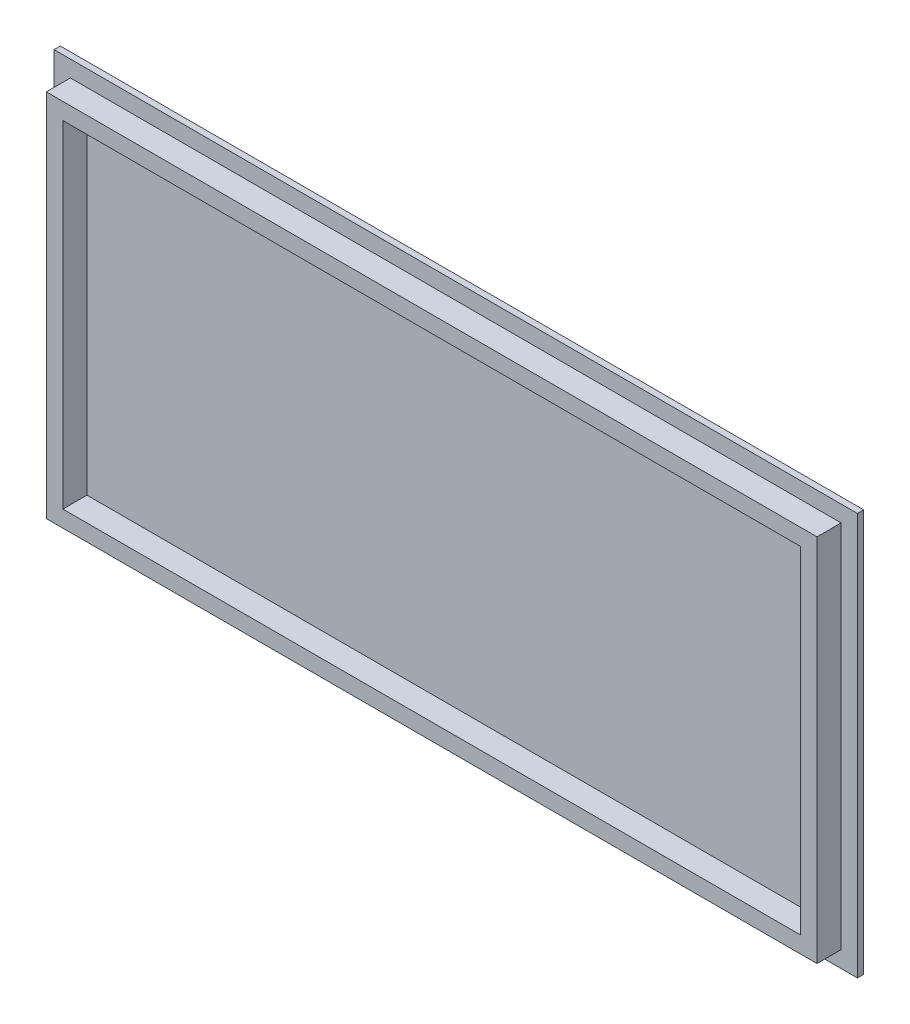
ISO-10303-21;
HEADER;
FILE_DESCRIPTION(('STEP AP214'),'2;1');
FILE_NAME('part.step','',(''),(''),'','','');
FILE_SCHEMA(('AUTOMOTIVE_DESIGN { 1 0 10303 214 1 1 1 1 }'));
ENDSEC;
DATA;
#1=APPLICATION_CONTEXT('core data for automotive mechanical design processes');
#2=APPLICATION_PROTOCOL_DEFINITION('international standard','automotive_design',2000,#1);
#3=PRODUCT_CONTEXT('',#1,'mechanical');
#4=PRODUCT('Part','Part','',(#3));
#5=PRODUCT_RELATED_PRODUCT_CATEGORY('part','',(#4));
#6=PRODUCT_DEFINITION_FORMATION('','',#4);
#7=PRODUCT_DEFINITION_CONTEXT('part definition',#1,'design');
#8=PRODUCT_DEFINITION('design','',#6,#7);
#9=PRODUCT_DEFINITION_SHAPE('','',#8);
#10=(LENGTH_UNIT() NAMED_UNIT(*) SI_UNIT(.MILLI.,.METRE.));
#11=(NAMED_UNIT(*) PLANE_ANGLE_UNIT() SI_UNIT($,.RADIAN.));
#12=(NAMED_UNIT(*) SI_UNIT($,.STERADIAN.) SOLID_ANGLE_UNIT());
#13=UNCERTAINTY_MEASURE_WITH_UNIT(LENGTH_MEASURE(1.E-05),#10,'distance_accuracy_value','');
#14=(GEOMETRIC_REPRESENTATION_CONTEXT(3) GLOBAL_UNCERTAINTY_ASSIGNED_CONTEXT((#13)) GLOBAL_UNIT_ASSIGNED_CONTEXT((#10,
#11,#12)) REPRESENTATION_CONTEXT('',''));
#15=CARTESIAN_POINT('',(0.,0.,0.));
#16=DIRECTION('',(0.,0.,1.));
#17=DIRECTION('',(1.,0.,0.));
#18=AXIS2_PLACEMENT_3D('',#15,#16,#17);
#19=CARTESIAN_POINT('',(0.,0.,3.));
#20=DIRECTION('',(0.,0.,1.));
#21=DIRECTION('',(1.,0.,0.));
#22=AXIS2_PLACEMENT_3D('',#19,#20,#21);
#23=PLANE('',#22);
#24=DIRECTION('',(0.,-1.,0.));
#25=VECTOR('',#24,1.);
#26=CARTESIAN_POINT('',(-7.91969303707388,-7.74484427014725,3.));
#27=LINE('',#26,#25);
#28=CARTESIAN_POINT('',(-7.91969303707386,184.295155729853,3.));
#29=VERTEX_POINT('',#28);
#30=CARTESIAN_POINT('',(-7.91969303707388,-7.74484427014725,3.));
#31=VERTEX_POINT('',#30);
#32=EDGE_CURVE('E194',#29,#31,#27,.T.);
#33=ORIENTED_EDGE('',*,*,#32,.T.);
#34=DIRECTION('',(1.,0.,0.));
#35=VECTOR('',#34,1.);
#36=CARTESIAN_POINT('',(375.550306962926,-7.74484427014723,3.));
#37=LINE('',#36,#35);
#38=CARTESIAN_POINT('',(375.550306962926,-7.74484427014723,3.));
#39=VERTEX_POINT('',#38);
#40=EDGE_CURVE('E197',#31,#39,#37,.T.);
#41=ORIENTED_EDGE('',*,*,#40,.T.);
#42=DIRECTION('',(0.,1.,0.));
#43=VECTOR('',#42,1.);
#44=CARTESIAN_POINT('',(375.550306962926,-7.74484427014723,3.));
#45=LINE('',#44,#43);
#46=CARTESIAN_POINT('',(375.550306962926,184.295155729853,3.));
#47=VERTEX_POINT('',#46);
#48=EDGE_CURVE('E200',#39,#47,#45,.T.);
#49=ORIENTED_EDGE('',*,*,#48,.T.);
#50=DIRECTION('',(-1.,0.,0.));
#51=VECTOR('',#50,1.);
#52=CARTESIAN_POINT('',(375.550306962926,184.295155729853,3.));
#53=LINE('',#52,#51);
#54=EDGE_CURVE('E202',#47,#29,#53,.T.);
#55=ORIENTED_EDGE('',*,*,#54,.T.);
#56=EDGE_LOOP('',(#33,#41,#49,#55));
#57=FACE_BOUND('',#56,.T.);
#58=DIRECTION('',(0.,-1.,0.));
#59=VECTOR('',#58,1.);
#60=CARTESIAN_POINT('',(367.772314810922,0.,3.));
#61=LINE('',#60,#59);
#62=CARTESIAN_POINT('',(367.772314810922,176.491576554324,3.));
#63=VERTEX_POINT('',#62);
#64=CARTESIAN_POINT('',(367.772314810922,0.0815765543243918,3.));
#65=VERTEX_POINT('',#64);
#66=EDGE_CURVE('E167',#63,#65,#61,.T.);
#67=ORIENTED_EDGE('',*,*,#66,.T.);
#68=DIRECTION('',(-1.,0.,0.));
#69=VECTOR('',#68,1.);
#70=CARTESIAN_POINT('',(0.,0.081576554324378,3.));
#71=LINE('',#70,#69);
#72=CARTESIAN_POINT('',(-0.107685189077916,0.0815765543243779,3.));
#73=VERTEX_POINT('',#72);
#74=EDGE_CURVE('E59',#65,#73,#71,.T.);
#75=ORIENTED_EDGE('',*,*,#74,.T.);
#76=DIRECTION('',(0.,1.,0.));
#77=VECTOR('',#76,1.);
#78=CARTESIAN_POINT('',(-0.107685189077916,0.,3.));
#79=LINE('',#78,#77);
#80=CARTESIAN_POINT('',(-0.107685189077901,176.491576554324,3.));
#81=VERTEX_POINT('',#80);
#82=EDGE_CURVE('E178',#73,#81,#79,.T.);
#83=ORIENTED_EDGE('',*,*,#82,.T.);
#84=DIRECTION('',(1.,0.,0.));
#85=VECTOR('',#84,1.);
#86=CARTESIAN_POINT('',(0.,176.491576554324,3.));
#87=LINE('',#86,#85);
#88=EDGE_CURVE('E181',#81,#63,#87,.T.);
#89=ORIENTED_EDGE('',*,*,#88,.T.);
#90=EDGE_LOOP('',(#67,#75,#83,#89));
#91=FACE_BOUND('',#90,.T.);
#92=ADVANCED_FACE('F36',(#57,#91),#23,.T.);
#93=CARTESIAN_POINT('',(-7.91969303707388,-7.74484427014725,3.));
#94=DIRECTION('',(1.,0.,0.));
#95=DIRECTION('',(0.,1.,0.));
#96=AXIS2_PLACEMENT_3D('',#93,#94,#95);
#97=PLANE('',#96);
#98=DIRECTION('',(0.,-1.,0.));
#99=VECTOR('',#98,1.);
#100=CARTESIAN_POINT('',(-7.91969303707388,-7.74484427014725,0.));
#101=LINE('',#100,#99);
#102=CARTESIAN_POINT('',(-7.91969303707386,184.295155729853,0.));
#103=VERTEX_POINT('',#102);
#104=CARTESIAN_POINT('',(-7.91969303707388,-7.74484427014725,0.));
#105=VERTEX_POINT('',#104);
#106=EDGE_CURVE('E188',#103,#105,#101,.T.);
#107=ORIENTED_EDGE('',*,*,#106,.T.);
#108=DIRECTION('',(0.,0.,-1.));
#109=VECTOR('',#108,1.);
#110=CARTESIAN_POINT('',(-7.91969303707388,-7.74484427014725,3.));
#111=LINE('',#110,#109);
#112=EDGE_CURVE('E11',#31,#105,#111,.T.);
#113=ORIENTED_EDGE('',*,*,#112,.F.);
#114=ORIENTED_EDGE('',*,*,#32,.F.);
#115=DIRECTION('',(0.,0.,-1.));
#116=VECTOR('',#115,1.);
#117=CARTESIAN_POINT('',(-7.91969303707386,184.295155729853,3.));
#118=LINE('',#117,#116);
#119=EDGE_CURVE('E204',#29,#103,#118,.T.);
#120=ORIENTED_EDGE('',*,*,#119,.T.);
#121=EDGE_LOOP('',(#107,#113,#114,#120));
#122=FACE_BOUND('',#121,.T.);
#123=ADVANCED_FACE('F38',(#122),#97,.F.);
#124=CARTESIAN_POINT('',(375.550306962926,-7.74484427014723,3.));
#125=DIRECTION('',(0.,1.,0.));
#126=DIRECTION('',(-1.,0.,0.));
#127=AXIS2_PLACEMENT_3D('',#124,#125,#126);
#128=PLANE('',#127);
#129=DIRECTION('',(1.,0.,0.));
#130=VECTOR('',#129,1.);
#131=CARTESIAN_POINT('',(375.550306962926,-7.74484427014723,0.));
#132=LINE('',#131,#130);
#133=CARTESIAN_POINT('',(375.550306962926,-7.74484427014723,0.));
#134=VERTEX_POINT('',#133);
#135=EDGE_CURVE('E207',#105,#134,#132,.T.);
#136=ORIENTED_EDGE('',*,*,#135,.T.);
#137=DIRECTION('',(0.,0.,-1.));
#138=VECTOR('',#137,1.);
#139=CARTESIAN_POINT('',(375.550306962926,-7.74484427014723,3.));
#140=LINE('',#139,#138);
#141=EDGE_CURVE('E44',#39,#134,#140,.T.);
#142=ORIENTED_EDGE('',*,*,#141,.F.);
#143=ORIENTED_EDGE('',*,*,#40,.F.);
#144=ORIENTED_EDGE('',*,*,#112,.T.);
#145=EDGE_LOOP('',(#136,#142,#143,#144));
#146=FACE_BOUND('',#145,.T.);
#147=ADVANCED_FACE('F237',(#146),#128,.F.);
#148=CARTESIAN_POINT('',(375.550306962926,-7.74484427014723,3.));
#149=DIRECTION('',(-1.,0.,0.));
#150=DIRECTION('',(0.,0.,1.));
#151=AXIS2_PLACEMENT_3D('',#148,#149,#150);
#152=PLANE('',#151);
#153=DIRECTION('',(0.,1.,0.));
#154=VECTOR('',#153,1.);
#155=CARTESIAN_POINT('',(375.550306962926,-7.74484427014723,0.));
#156=LINE('',#155,#154);
#157=CARTESIAN_POINT('',(375.550306962926,184.295155729853,0.));
#158=VERTEX_POINT('',#157);
#159=EDGE_CURVE('E209',#134,#158,#156,.T.);
#160=ORIENTED_EDGE('',*,*,#159,.T.);
#161=DIRECTION('',(0.,0.,-1.));
#162=VECTOR('',#161,1.);
#163=CARTESIAN_POINT('',(375.550306962926,184.295155729853,3.));
#164=LINE('',#163,#162);
#165=EDGE_CURVE('E214',#47,#158,#164,.T.);
#166=ORIENTED_EDGE('',*,*,#165,.F.);
#167=ORIENTED_EDGE('',*,*,#48,.F.);
#168=ORIENTED_EDGE('',*,*,#141,.T.);
#169=EDGE_LOOP('',(#160,#166,#167,#168));
#170=FACE_BOUND('',#169,.T.);
#171=ADVANCED_FACE('F221',(#170),#152,.F.);
#172=CARTESIAN_POINT('',(375.550306962926,184.295155729853,3.));
#173=DIRECTION('',(0.,-1.,0.));
#174=DIRECTION('',(1.,0.,0.));
#175=AXIS2_PLACEMENT_3D('',#172,#173,#174);
#176=PLANE('',#175);
#177=DIRECTION('',(-1.,0.,0.));
#178=VECTOR('',#177,1.);
#179=CARTESIAN_POINT('',(375.550306962926,184.295155729853,0.));
#180=LINE('',#179,#178);
#181=EDGE_CURVE('E198',#158,#103,#180,.T.);
#182=ORIENTED_EDGE('',*,*,#181,.T.);
#183=ORIENTED_EDGE('',*,*,#119,.F.);
#184=ORIENTED_EDGE('',*,*,#54,.F.);
#185=ORIENTED_EDGE('',*,*,#165,.T.);
#186=EDGE_LOOP('',(#182,#183,#184,#185));
#187=FACE_BOUND('',#186,.T.);
#188=ADVANCED_FACE('F230',(#187),#176,.F.);
#189=CARTESIAN_POINT('',(0.,0.,0.));
#190=DIRECTION('',(0.,0.,1.));
#191=DIRECTION('',(1.,0.,0.));
#192=AXIS2_PLACEMENT_3D('',#189,#190,#191);
#193=PLANE('',#192);
#194=ORIENTED_EDGE('',*,*,#106,.F.);
#195=ORIENTED_EDGE('',*,*,#181,.F.);
#196=ORIENTED_EDGE('',*,*,#159,.F.);
#197=ORIENTED_EDGE('',*,*,#135,.F.);
#198=EDGE_LOOP('',(#194,#195,#196,#197));
#199=FACE_BOUND('',#198,.T.);
#200=ADVANCED_FACE('F227',(#199),#193,.F.);
#201=CARTESIAN_POINT('',(0.,0.081576554324378,14.5));
#202=DIRECTION('',(0.,-1.,0.));
#203=DIRECTION('',(1.,0.,0.));
#204=AXIS2_PLACEMENT_3D('',#201,#202,#203);
#205=PLANE('',#204);
#206=ORIENTED_EDGE('',*,*,#74,.F.);
#207=DIRECTION('',(0.,0.,-1.));
#208=VECTOR('',#207,1.);
#209=CARTESIAN_POINT('',(367.772314810922,0.0815765543243918,14.5));
#210=LINE('',#209,#208);
#211=CARTESIAN_POINT('',(367.772314810922,0.0815765543243918,14.5));
#212=VERTEX_POINT('',#211);
#213=EDGE_CURVE('E186',#212,#65,#210,.T.);
#214=ORIENTED_EDGE('',*,*,#213,.F.);
#215=DIRECTION('',(-1.,0.,0.));
#216=VECTOR('',#215,1.);
#217=CARTESIAN_POINT('',(0.,0.081576554324378,14.5));
#218=LINE('',#217,#216);
#219=CARTESIAN_POINT('',(-0.107685189077916,0.0815765543243779,14.5));
#220=VERTEX_POINT('',#219);
#221=EDGE_CURVE('E163',#212,#220,#218,.T.);
#222=ORIENTED_EDGE('',*,*,#221,.T.);
#223=DIRECTION('',(0.,0.,-1.));
#224=VECTOR('',#223,1.);
#225=CARTESIAN_POINT('',(-0.107685189077916,0.0815765543243779,14.5));
#226=LINE('',#225,#224);
#227=EDGE_CURVE('E176',#220,#73,#226,.T.);
#228=ORIENTED_EDGE('',*,*,#227,.T.);
#229=EDGE_LOOP('',(#206,#214,#222,#228));
#230=FACE_BOUND('',#229,.T.);
#231=ADVANCED_FACE('F250',(#230),#205,.T.);
#232=CARTESIAN_POINT('',(367.772314810922,0.,14.5));
#233=DIRECTION('',(1.,0.,0.));
#234=DIRECTION('',(0.,0.,-1.));
#235=AXIS2_PLACEMENT_3D('',#232,#233,#234);
#236=PLANE('',#235);
#237=ORIENTED_EDGE('',*,*,#66,.F.);
#238=DIRECTION('',(0.,0.,-1.));
#239=VECTOR('',#238,1.);
#240=CARTESIAN_POINT('',(367.772314810922,176.491576554324,14.5));
#241=LINE('',#240,#239);
#242=CARTESIAN_POINT('',(367.772314810922,176.491576554324,14.5));
#243=VERTEX_POINT('',#242);
#244=EDGE_CURVE('E189',#243,#63,#241,.T.);
#245=ORIENTED_EDGE('',*,*,#244,.F.);
#246=DIRECTION('',(0.,-1.,0.));
#247=VECTOR('',#246,1.);
#248=CARTESIAN_POINT('',(367.772314810922,0.,14.5));
#249=LINE('',#248,#247);
#250=EDGE_CURVE('E173',#243,#212,#249,.T.);
#251=ORIENTED_EDGE('',*,*,#250,.T.);
#252=ORIENTED_EDGE('',*,*,#213,.T.);
#253=EDGE_LOOP('',(#237,#245,#251,#252));
#254=FACE_BOUND('',#253,.T.);
#255=ADVANCED_FACE('F269',(#254),#236,.T.);
#256=CARTESIAN_POINT('',(0.,176.491576554324,14.5));
#257=DIRECTION('',(0.,1.,0.));
#258=DIRECTION('',(-1.,0.,0.));
#259=AXIS2_PLACEMENT_3D('',#256,#257,#258);
#260=PLANE('',#259);
#261=ORIENTED_EDGE('',*,*,#88,.F.);
#262=DIRECTION('',(0.,0.,-1.));
#263=VECTOR('',#262,1.);
#264=CARTESIAN_POINT('',(-0.107685189077901,176.491576554324,14.5));
#265=LINE('',#264,#263);
#266=CARTESIAN_POINT('',(-0.107685189077901,176.491576554324,14.5));
#267=VERTEX_POINT('',#266);
#268=EDGE_CURVE('E191',#267,#81,#265,.T.);
#269=ORIENTED_EDGE('',*,*,#268,.F.);
#270=DIRECTION('',(1.,0.,0.));
#271=VECTOR('',#270,1.);
#272=CARTESIAN_POINT('',(0.,176.491576554324,14.5));
#273=LINE('',#272,#271);
#274=EDGE_CURVE('E170',#267,#243,#273,.T.);
#275=ORIENTED_EDGE('',*,*,#274,.T.);
#276=ORIENTED_EDGE('',*,*,#244,.T.);
#277=EDGE_LOOP('',(#261,#269,#275,#276));
#278=FACE_BOUND('',#277,.T.);
#279=ADVANCED_FACE('F275',(#278),#260,.T.);
#280=CARTESIAN_POINT('',(-0.107685189077916,0.,14.5));
#281=DIRECTION('',(-1.,0.,0.));
#282=DIRECTION('',(0.,-1.,0.));
#283=AXIS2_PLACEMENT_3D('',#280,#281,#282);
#284=PLANE('',#283);
#285=ORIENTED_EDGE('',*,*,#82,.F.);
#286=ORIENTED_EDGE('',*,*,#227,.F.);
#287=DIRECTION('',(0.,1.,0.));
#288=VECTOR('',#287,1.);
#289=CARTESIAN_POINT('',(-0.107685189077916,0.,14.5));
#290=LINE('',#289,#288);
#291=EDGE_CURVE('E166',#220,#267,#290,.T.);
#292=ORIENTED_EDGE('',*,*,#291,.T.);
#293=ORIENTED_EDGE('',*,*,#268,.T.);
#294=EDGE_LOOP('',(#285,#286,#292,#293));
#295=FACE_BOUND('',#294,.T.);
#296=ADVANCED_FACE('F283',(#295),#284,.T.);
#297=CARTESIAN_POINT('',(0.,0.,14.5));
#298=DIRECTION('',(0.,0.,-1.));
#299=DIRECTION('',(-1.,0.,0.));
#300=AXIS2_PLACEMENT_3D('',#297,#298,#299);
#301=PLANE('',#300);
#302=DIRECTION('',(0.,1.,0.));
#303=VECTOR('',#302,1.);
#304=CARTESIAN_POINT('',(359.862427543318,0.,14.5));
#305=LINE('',#304,#303);
#306=CARTESIAN_POINT('',(359.862427543318,7.97262699999995,14.5));
#307=VERTEX_POINT('',#306);
#308=CARTESIAN_POINT('',(359.862427543318,168.592627,14.5));
#309=VERTEX_POINT('',#308);
#310=EDGE_CURVE('E154',#307,#309,#305,.T.);
#311=ORIENTED_EDGE('',*,*,#310,.F.);
#312=DIRECTION('',(1.,0.,0.));
#313=VECTOR('',#312,1.);
#314=CARTESIAN_POINT('',(0.,7.97262699999995,14.5));
#315=LINE('',#314,#313);
#316=CARTESIAN_POINT('',(7.79242754331808,7.97262699999995,14.5));
#317=VERTEX_POINT('',#316);
#318=EDGE_CURVE('E51',#317,#307,#315,.T.);
#319=ORIENTED_EDGE('',*,*,#318,.F.);
#320=DIRECTION('',(0.,-1.,0.));
#321=VECTOR('',#320,1.);
#322=CARTESIAN_POINT('',(7.79242754331808,0.,14.5));
#323=LINE('',#322,#321);
#324=CARTESIAN_POINT('',(7.79242754331808,168.592627,14.5));
#325=VERTEX_POINT('',#324);
#326=EDGE_CURVE('E145',#325,#317,#323,.T.);
#327=ORIENTED_EDGE('',*,*,#326,.F.);
#328=DIRECTION('',(-1.,0.,0.));
#329=VECTOR('',#328,1.);
#330=CARTESIAN_POINT('',(0.,168.592627,14.5));
#331=LINE('',#330,#329);
#332=EDGE_CURVE('E148',#309,#325,#331,.T.);
#333=ORIENTED_EDGE('',*,*,#332,.F.);
#334=EDGE_LOOP('',(#311,#319,#327,#333));
#335=FACE_BOUND('',#334,.T.);
#336=ORIENTED_EDGE('',*,*,#221,.F.);
#337=ORIENTED_EDGE('',*,*,#250,.F.);
#338=ORIENTED_EDGE('',*,*,#274,.F.);
#339=ORIENTED_EDGE('',*,*,#291,.F.);
#340=EDGE_LOOP('',(#336,#337,#338,#339));
#341=FACE_BOUND('',#340,.T.);
#342=ADVANCED_FACE('F291',(#335,#341),#301,.F.);
#343=CARTESIAN_POINT('',(0.,7.97262699999995,3.));
#344=DIRECTION('',(0.,-1.,0.));
#345=DIRECTION('',(0.,0.,-1.));
#346=AXIS2_PLACEMENT_3D('',#343,#344,#345);
#347=PLANE('',#346);
#348=ORIENTED_EDGE('',*,*,#318,.T.);
#349=DIRECTION('',(0.,0.,1.));
#350=VECTOR('',#349,1.);
#351=CARTESIAN_POINT('',(359.862427543318,7.97262699999995,3.));
#352=LINE('',#351,#350);
#353=CARTESIAN_POINT('',(359.862427543318,7.97262699999995,3.));
#354=VERTEX_POINT('',#353);
#355=EDGE_CURVE('E123',#354,#307,#352,.T.);
#356=ORIENTED_EDGE('',*,*,#355,.F.);
#357=DIRECTION('',(1.,0.,0.));
#358=VECTOR('',#357,1.);
#359=CARTESIAN_POINT('',(0.,7.97262699999995,3.));
#360=LINE('',#359,#358);
#361=CARTESIAN_POINT('',(7.79242754331808,7.97262699999995,3.));
#362=VERTEX_POINT('',#361);
#363=EDGE_CURVE('E127',#362,#354,#360,.T.);
#364=ORIENTED_EDGE('',*,*,#363,.F.);
#365=DIRECTION('',(0.,0.,1.));
#366=VECTOR('',#365,1.);
#367=CARTESIAN_POINT('',(7.79242754331808,7.97262699999995,3.));
#368=LINE('',#367,#366);
#369=EDGE_CURVE('E158',#362,#317,#368,.T.);
#370=ORIENTED_EDGE('',*,*,#369,.T.);
#371=EDGE_LOOP('',(#348,#356,#364,#370));
#372=FACE_BOUND('',#371,.T.);
#373=ADVANCED_FACE('F125',(#372),#347,.F.);
#374=CARTESIAN_POINT('',(7.79242754331808,0.,3.));
#375=DIRECTION('',(-1.,0.,0.));
#376=DIRECTION('',(0.,0.,1.));
#377=AXIS2_PLACEMENT_3D('',#374,#375,#376);
#378=PLANE('',#377);
#379=ORIENTED_EDGE('',*,*,#326,.T.);
#380=ORIENTED_EDGE('',*,*,#369,.F.);
#381=DIRECTION('',(0.,-1.,0.));
#382=VECTOR('',#381,1.);
#383=CARTESIAN_POINT('',(7.79242754331808,0.,3.));
#384=LINE('',#383,#382);
#385=CARTESIAN_POINT('',(7.79242754331808,168.592627,3.));
#386=VERTEX_POINT('',#385);
#387=EDGE_CURVE('E133',#386,#362,#384,.T.);
#388=ORIENTED_EDGE('',*,*,#387,.F.);
#389=DIRECTION('',(0.,0.,1.));
#390=VECTOR('',#389,1.);
#391=CARTESIAN_POINT('',(7.79242754331808,168.592627,3.));
#392=LINE('',#391,#390);
#393=EDGE_CURVE('E160',#386,#325,#392,.T.);
#394=ORIENTED_EDGE('',*,*,#393,.T.);
#395=EDGE_LOOP('',(#379,#380,#388,#394));
#396=FACE_BOUND('',#395,.T.);
#397=ADVANCED_FACE('F305',(#396),#378,.F.);
#398=CARTESIAN_POINT('',(0.,168.592627,3.));
#399=DIRECTION('',(0.,1.,0.));
#400=DIRECTION('',(0.,0.,1.));
#401=AXIS2_PLACEMENT_3D('',#398,#399,#400);
#402=PLANE('',#401);
#403=ORIENTED_EDGE('',*,*,#332,.T.);
#404=ORIENTED_EDGE('',*,*,#393,.F.);
#405=DIRECTION('',(-1.,0.,0.));
#406=VECTOR('',#405,1.);
#407=CARTESIAN_POINT('',(0.,168.592627,3.));
#408=LINE('',#407,#406);
#409=CARTESIAN_POINT('',(359.862427543318,168.592627,3.));
#410=VERTEX_POINT('',#409);
#411=EDGE_CURVE('E141',#410,#386,#408,.T.);
#412=ORIENTED_EDGE('',*,*,#411,.F.);
#413=DIRECTION('',(0.,0.,1.));
#414=VECTOR('',#413,1.);
#415=CARTESIAN_POINT('',(359.862427543318,168.592627,3.));
#416=LINE('',#415,#414);
#417=EDGE_CURVE('E132',#410,#309,#416,.T.);
#418=ORIENTED_EDGE('',*,*,#417,.T.);
#419=EDGE_LOOP('',(#403,#404,#412,#418));
#420=FACE_BOUND('',#419,.T.);
#421=ADVANCED_FACE('F312',(#420),#402,.F.);
#422=CARTESIAN_POINT('',(359.862427543318,0.,3.));
#423=DIRECTION('',(1.,0.,0.));
#424=DIRECTION('',(0.,0.,-1.));
#425=AXIS2_PLACEMENT_3D('',#422,#423,#424);
#426=PLANE('',#425);
#427=ORIENTED_EDGE('',*,*,#310,.T.);
#428=ORIENTED_EDGE('',*,*,#417,.F.);
#429=DIRECTION('',(0.,1.,0.));
#430=VECTOR('',#429,1.);
#431=CARTESIAN_POINT('',(359.862427543318,0.,3.));
#432=LINE('',#431,#430);
#433=EDGE_CURVE('E136',#354,#410,#432,.T.);
#434=ORIENTED_EDGE('',*,*,#433,.F.);
#435=ORIENTED_EDGE('',*,*,#355,.T.);
#436=EDGE_LOOP('',(#427,#428,#434,#435));
#437=FACE_BOUND('',#436,.T.);
#438=ADVANCED_FACE('F137',(#437),#426,.F.);
#439=CARTESIAN_POINT('',(0.,0.,3.));
#440=DIRECTION('',(0.,0.,1.));
#441=DIRECTION('',(1.,0.,0.));
#442=AXIS2_PLACEMENT_3D('',#439,#440,#441);
#443=PLANE('',#442);
#444=ORIENTED_EDGE('',*,*,#363,.T.);
#445=ORIENTED_EDGE('',*,*,#433,.T.);
#446=ORIENTED_EDGE('',*,*,#411,.T.);
#447=ORIENTED_EDGE('',*,*,#387,.T.);
#448=EDGE_LOOP('',(#444,#445,#446,#447));
#449=FACE_BOUND('',#448,.T.);
#450=ADVANCED_FACE('F143',(#449),#443,.T.);
#451=CLOSED_SHELL('',(#92,#123,#147,#171,#188,#200,#231,#255,#279,#296,#342,#373,#397,#421,#438,#450));
#452=MANIFOLD_SOLID_BREP('B2',#451);
#453=ADVANCED_BREP_SHAPE_REPRESENTATION('',(#18,#452),#14);
#454=SHAPE_DEFINITION_REPRESENTATION(#9,#453);
ENDSEC;
END-ISO-10303-21;
